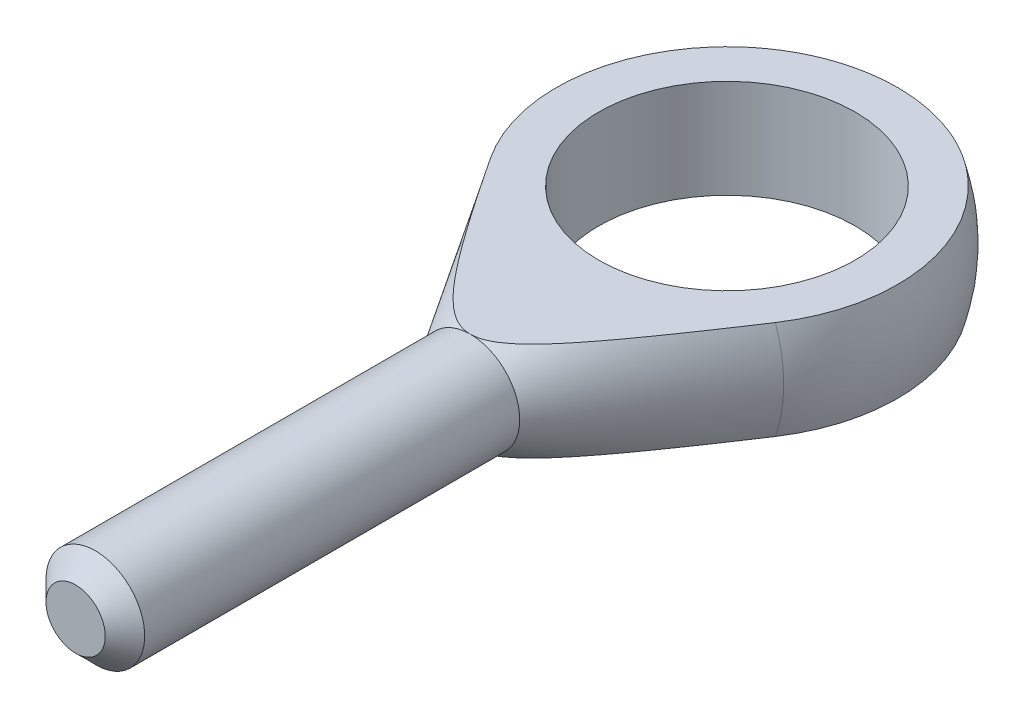
ISO-10303-21;
HEADER;
FILE_DESCRIPTION(('STEP AP214'),'2;1');
FILE_NAME('part.step','',(''),(''),'','','');
FILE_SCHEMA(('AUTOMOTIVE_DESIGN { 1 0 10303 214 1 1 1 1 }'));
ENDSEC;
DATA;
#1=APPLICATION_CONTEXT('core data for automotive mechanical design processes');
#2=APPLICATION_PROTOCOL_DEFINITION('international standard','automotive_design',2000,#1);
#3=PRODUCT_CONTEXT('',#1,'mechanical');
#4=PRODUCT('Part','Part','',(#3));
#5=PRODUCT_RELATED_PRODUCT_CATEGORY('part','',(#4));
#6=PRODUCT_DEFINITION_FORMATION('','',#4);
#7=PRODUCT_DEFINITION_CONTEXT('part definition',#1,'design');
#8=PRODUCT_DEFINITION('design','',#6,#7);
#9=PRODUCT_DEFINITION_SHAPE('','',#8);
#10=(LENGTH_UNIT() NAMED_UNIT(*) SI_UNIT(.MILLI.,.METRE.));
#11=(NAMED_UNIT(*) PLANE_ANGLE_UNIT() SI_UNIT($,.RADIAN.));
#12=(NAMED_UNIT(*) SI_UNIT($,.STERADIAN.) SOLID_ANGLE_UNIT());
#13=UNCERTAINTY_MEASURE_WITH_UNIT(LENGTH_MEASURE(1.E-05),#10,'distance_accuracy_value','');
#14=(GEOMETRIC_REPRESENTATION_CONTEXT(3) GLOBAL_UNCERTAINTY_ASSIGNED_CONTEXT((#13)) GLOBAL_UNIT_ASSIGNED_CONTEXT((#10,
#11,#12)) REPRESENTATION_CONTEXT('',''));
#15=CARTESIAN_POINT('',(0.,0.,0.));
#16=DIRECTION('',(0.,0.,1.));
#17=DIRECTION('',(1.,0.,0.));
#18=AXIS2_PLACEMENT_3D('',#15,#16,#17);
#19=CARTESIAN_POINT('',(0.,0.,13.));
#20=DIRECTION('',(0.,0.,-1.));
#21=DIRECTION('',(-1.,0.,0.));
#22=AXIS2_PLACEMENT_3D('',#19,#20,#21);
#23=CONICAL_SURFACE('',#22,2.5,0.557570628406619);
#24=CARTESIAN_POINT('',(0.,0.,4.7621370146182));
#25=DIRECTION('',(0.,0.,-1.));
#26=DIRECTION('',(-1.,0.,0.));
#27=AXIS2_PLACEMENT_3D('',#24,#25,#26);
#28=CIRCLE('',#27,7.63688752398537);
#29=CARTESIAN_POINT('',(-7.21609666329403,-2.5,4.7621370146182));
#30=VERTEX_POINT('',#29);
#31=CARTESIAN_POINT('',(-7.21609666329403,2.5,4.7621370146182));
#32=VERTEX_POINT('',#31);
#33=EDGE_CURVE('E97',#30,#32,#28,.T.);
#34=ORIENTED_EDGE('',*,*,#33,.F.);
#35=CARTESIAN_POINT('',(-18.2881757597772,-2.5,-12.5917539697787));
#36=CARTESIAN_POINT('',(-17.7682888026947,-2.5,-11.7657407888707));
#37=CARTESIAN_POINT('',(-17.248136660803,-2.5,-10.9398942340084));
#38=CARTESIAN_POINT('',(-16.207058131939,-2.5,-9.28867174331785));
#39=CARTESIAN_POINT('',(-15.686131733287,-2.5,-8.46329581485431));
#40=CARTESIAN_POINT('',(-14.6427591085271,-2.5,-6.81235822397228));
#41=CARTESIAN_POINT('',(-14.1203118871105,-2.5,-5.98679719031958));
#42=CARTESIAN_POINT('',(-13.0740307179517,-2.5,-4.33657004445696));
#43=CARTESIAN_POINT('',(-12.5501967893148,-2.5,-3.51190392013588));
#44=CARTESIAN_POINT('',(-11.4688660672409,-2.5,-1.81409004676087));
#45=CARTESIAN_POINT('',(-10.9112460131544,-2.5,-0.941020702201023));
#46=CARTESIAN_POINT('',(-10.0721913889547,-2.5,0.366927176896181));
#47=CARTESIAN_POINT('',(-9.79206288359678,-2.5,0.802643371143948));
#48=CARTESIAN_POINT('',(-9.23067810446317,-2.5,1.67334752542579));
#49=CARTESIAN_POINT('',(-8.94942183334861,-2.5,2.10833548717482));
#50=CARTESIAN_POINT('',(-8.3856511525547,-2.5,2.97702468216167));
#51=CARTESIAN_POINT('',(-8.1031378661137,-2.5,3.41072664376695));
#52=CARTESIAN_POINT('',(-7.53613047487403,-2.5,4.27683259865021));
#53=CARTESIAN_POINT('',(-7.2516363766262,-2.5,4.70923659621398));
#54=CARTESIAN_POINT('',(-6.67992160772568,-2.5,5.57219831538375));
#55=CARTESIAN_POINT('',(-6.3927011345619,-2.5,6.0027561674872));
#56=CARTESIAN_POINT('',(-5.95886243695519,-2.5,6.64656087812406));
#57=CARTESIAN_POINT('',(-5.8137495095323,-2.5,6.860821875155));
#58=CARTESIAN_POINT('',(-5.52227883374032,-2.5,7.28849502492086));
#59=CARTESIAN_POINT('',(-5.3759210911839,-2.5,7.50190718161262));
#60=CARTESIAN_POINT('',(-5.10207787126165,-2.5,7.89810293807199));
#61=CARTESIAN_POINT('',(-4.97479332060087,-2.5,8.08102531494501));
#62=CARTESIAN_POINT('',(-4.71879993180027,-2.5,8.44587885864129));
#63=CARTESIAN_POINT('',(-4.59009105767206,-2.5,8.62781000024486));
#64=CARTESIAN_POINT('',(-4.33074446945655,-2.5,8.99061800726985));
#65=CARTESIAN_POINT('',(-4.20010466388128,-2.5,9.17149338018632));
#66=CARTESIAN_POINT('',(-3.93656360351345,-2.5,9.53157546331069));
#67=CARTESIAN_POINT('',(-3.80366248795132,-2.5,9.71078227520941));
#68=CARTESIAN_POINT('',(-3.53623694800413,-2.5,10.0652044013027));
#69=CARTESIAN_POINT('',(-3.40174174798398,-2.5,10.2404416804207));
#70=CARTESIAN_POINT('',(-3.1288445434353,-2.5,10.5879300657296));
#71=CARTESIAN_POINT('',(-2.99044153180763,-2.5,10.7601803833312));
#72=CARTESIAN_POINT('',(-2.70855766832285,-2.5,11.100008435456));
#73=CARTESIAN_POINT('',(-2.56508637019778,-2.5,11.2675939972314));
#74=CARTESIAN_POINT('',(-2.34420443657334,-2.5,11.5138201849649));
#75=CARTESIAN_POINT('',(-2.26964874838444,-2.5,11.5950191558557));
#76=CARTESIAN_POINT('',(-2.11821185993539,-2.5,11.7552127642965));
#77=CARTESIAN_POINT('',(-2.0413309706652,-2.5,11.8342076939384));
#78=CARTESIAN_POINT('',(-1.90921725022562,-2.5,11.965047434545));
#79=CARTESIAN_POINT('',(-1.85473850281824,-2.5,12.0176528777633));
#80=CARTESIAN_POINT('',(-1.74420922953727,-2.5,12.1212037277911));
#81=CARTESIAN_POINT('',(-1.68815854232559,-2.5,12.1721489630342));
#82=CARTESIAN_POINT('',(-1.5740711440497,-2.5,12.2721260372992));
#83=CARTESIAN_POINT('',(-1.51602902352513,-2.5,12.3211517369287));
#84=CARTESIAN_POINT('',(-1.39783192904802,-2.5,12.4165928433272));
#85=CARTESIAN_POINT('',(-1.33767698892405,-2.5,12.4630082918582));
#86=CARTESIAN_POINT('',(-1.2140703737968,-2.5,12.5531367318292));
#87=CARTESIAN_POINT('',(-1.15058487685415,-2.5,12.5968041151025));
#88=CARTESIAN_POINT('',(-1.0208083247317,-2.5,12.6797139217727));
#89=CARTESIAN_POINT('',(-0.954516468686385,-2.5,12.7189550701637));
#90=CARTESIAN_POINT('',(-0.75146782596317,-2.5,12.8277611200423));
#91=CARTESIAN_POINT('',(-0.609770402141401,-2.5,12.8890055970211));
#92=CARTESIAN_POINT('',(-0.373520192393497,-2.5,12.9579292080534));
#93=CARTESIAN_POINT('',(-0.282397412226252,-2.5,12.9772064333061));
#94=CARTESIAN_POINT('',(-0.098198279336053,-2.5,12.9995975079074));
#95=CARTESIAN_POINT('',(-0.00512464905328752,-2.5,13.0027325487879));
#96=CARTESIAN_POINT('',(0.179996122096402,-2.5,12.9923649251489));
#97=CARTESIAN_POINT('',(0.27204372559783,-2.5,12.9788700928474));
#98=CARTESIAN_POINT('',(0.452809073253061,-2.5,12.9373094582093));
#99=CARTESIAN_POINT('',(0.541521468499796,-2.5,12.9092212380339));
#100=CARTESIAN_POINT('',(0.698697411022234,-2.5,12.847828221667));
#101=CARTESIAN_POINT('',(0.767917291021758,-2.5,12.8163909348296));
#102=CARTESIAN_POINT('',(0.903350894020853,-2.5,12.7475400960999));
#103=CARTESIAN_POINT('',(0.969562287205733,-2.5,12.7101220105843));
#104=CARTESIAN_POINT('',(1.09936359122282,-2.5,12.6305431750714));
#105=CARTESIAN_POINT('',(1.16294319091136,-2.5,12.5883658137448));
#106=CARTESIAN_POINT('',(1.28752364357328,-2.5,12.5004390874071));
#107=CARTESIAN_POINT('',(1.34852543712064,-2.5,12.4546910428974));
#108=CARTESIAN_POINT('',(1.51538398203663,-2.5,12.3233669992286));
#109=CARTESIAN_POINT('',(1.61882993285973,-2.5,12.2347366978852));
#110=CARTESIAN_POINT('',(1.82037566268882,-2.5,12.0515532168382));
#111=CARTESIAN_POINT('',(1.91847126723923,-2.5,11.9569955326721));
#112=CARTESIAN_POINT('',(2.11072271367264,-2.5,11.7635472703571));
#113=CARTESIAN_POINT('',(2.20486896739184,-2.5,11.6646472198529));
#114=CARTESIAN_POINT('',(2.38991415918624,-2.5,11.4638501163862));
#115=CARTESIAN_POINT('',(2.48081266587183,-2.5,11.3619526685408));
#116=CARTESIAN_POINT('',(2.66054095748691,-2.5,11.1553347812926));
#117=CARTESIAN_POINT('',(2.74935598928386,-2.5,11.0506015571392));
#118=CARTESIAN_POINT('',(2.92489565798002,-2.5,10.8393917254354));
#119=CARTESIAN_POINT('',(3.01162015897374,-2.5,10.7329150052919));
#120=CARTESIAN_POINT('',(3.18322336602367,-2.5,10.5187680656925));
#121=CARTESIAN_POINT('',(3.2681048129723,-2.5,10.4111000378492));
#122=CARTESIAN_POINT('',(3.43645627189603,-2.5,10.1946737963466));
#123=CARTESIAN_POINT('',(3.51992632865597,-2.5,10.085915617454));
#124=CARTESIAN_POINT('',(3.76606608608213,-2.5,9.76162856245453));
#125=CARTESIAN_POINT('',(3.92705372875055,-2.5,9.54482329717138));
#126=CARTESIAN_POINT('',(4.24576491214583,-2.5,9.10882276107777));
#127=CARTESIAN_POINT('',(4.40348829294268,-2.5,8.8896273739647));
#128=CARTESIAN_POINT('',(4.71650646632739,-2.5,8.44946171394241));
#129=CARTESIAN_POINT('',(4.87180088610348,-2.5,8.22849117629945));
#130=CARTESIAN_POINT('',(5.18050193501725,-2.5,7.78523412215401));
#131=CARTESIAN_POINT('',(5.33390854256231,-2.5,7.5629475906423));
#132=CARTESIAN_POINT('',(5.79223588980394,-2.5,6.89412941343366));
#133=CARTESIAN_POINT('',(6.09494921903567,-2.5,6.44608601289233));
#134=CARTESIAN_POINT('',(6.69654427945743,-2.5,5.54750251995014));
#135=CARTESIAN_POINT('',(6.99542635183088,-2.5,5.09696265505619));
#136=CARTESIAN_POINT('',(7.58894611070125,-2.5,4.1965843050114));
#137=CARTESIAN_POINT('',(7.88359800304257,-2.5,3.74675517655552));
#138=CARTESIAN_POINT('',(8.47103114885836,-2.5,2.84586412145668));
#139=CARTESIAN_POINT('',(8.76381235998802,-2.5,2.39480216723511));
#140=CARTESIAN_POINT('',(9.34784897059113,-2.5,1.49197191220457));
#141=CARTESIAN_POINT('',(9.63910498158493,-2.5,1.04020400677384));
#142=CARTESIAN_POINT('',(10.2205455996726,-2.5,0.135979050704919));
#143=CARTESIAN_POINT('',(10.5107302058402,-2.5,-0.316478000528654));
#144=CARTESIAN_POINT('',(11.4277010918932,-2.5,-1.7490966627965));
#145=CARTESIAN_POINT('',(12.0529656611428,-2.5,-2.73023206891367));
#146=CARTESIAN_POINT('',(13.3011892721116,-2.5,-4.6941709504664));
#147=CARTESIAN_POINT('',(13.924147957662,-2.5,-5.67697465197927));
#148=CARTESIAN_POINT('',(15.1713152421438,-2.5,-7.648108000279));
#149=CARTESIAN_POINT('',(15.7955164638271,-2.5,-8.63644231332962));
#150=CARTESIAN_POINT('',(17.0426559656668,-2.5,-10.613694502661));
#151=CARTESIAN_POINT('',(17.6655944257596,-2.5,-11.6026122654288));
#152=CARTESIAN_POINT('',(18.2881757597772,-2.5,-12.5917539697787));
#153=B_SPLINE_CURVE_WITH_KNOTS('',3,(#35,#36,#37,#38,#39,#40,#41,#42,#43,#44,#45,#46,#47,#48,
#49,#50,#51,#52,#53,#54,#55,#56,#57,#58,#59,#60,#61,#62,#63,#64,#65,#66,#67,#68,#69,#70,#71,#72,
#73,#74,#75,#76,#77,#78,#79,#80,#81,#82,#83,#84,#85,#86,#87,#88,#89,#90,#91,#92,#93,#94,#95,#96,
#97,#98,#99,#100,#101,#102,#103,#104,#105,#106,#107,#108,#109,#110,#111,#112,#113,#114,#115,
#116,#117,#118,#119,#120,#121,#122,#123,#124,#125,#126,#127,#128,#129,#130,#131,#132,#133,#134,
#135,#136,#137,#138,#139,#140,#141,#142,#143,#144,#145,#146,#147,#148,#149,#150,#151,#152),
.UNSPECIFIED.,.F.,.F.,(4,2,2,2,2,2,2,2,2,2,2,2,2,2,2,2,2,2,2,2,2,2,2,2,2,2,2,2,2,2,2,2,2,2,2,2,
2,2,2,2,2,2,2,2,2,2,2,2,2,2,2,2,2,2,2,2,2,2,4),(0.,2.92800678524869,5.85605819752975,
8.78701583191268,11.7179332930656,14.8257738356141,16.3797626504383,17.9337478005356,
19.4865476836905,21.0393424339418,22.5920255508061,23.368353309795,24.1446774457099,
24.8132210074027,25.4817814999356,26.1511287020946,26.8204348401508,27.4830947357422,
28.1459269957651,28.8075702957815,29.1382428246635,29.4688713207994,29.6960382991699,
29.9232286790683,30.1510945548394,30.378956783887,30.6099334291215,30.8409764396853,
31.3001689360316,31.5783794475503,31.8562246297722,32.1339390044647,32.4120812609321,
32.6398235463686,32.8677392931821,33.0964766920657,33.325129897031,33.7334154791419,
34.1420151867939,34.5515553980682,34.9611498067672,35.3730799754716,35.7850368519456,
36.1963320655631,36.6076142037868,37.4176845367706,38.2277944650192,39.0380275372785,
39.8482698683106,41.4703943636031,43.092373386648,44.7055912294916,46.3188454607327,
47.9313938705036,49.5439436742069,53.0342437887965,56.5250622263276,60.0318955460197,
63.5381880041753),.UNSPECIFIED.);
#154=CARTESIAN_POINT('',(0.,-2.5,13.));
#155=VERTEX_POINT('',#154);
#156=EDGE_CURVE('E93',#30,#155,#153,.T.);
#157=ORIENTED_EDGE('',*,*,#156,.T.);
#158=CARTESIAN_POINT('',(0.,0.,13.));
#159=DIRECTION('',(0.,0.,-1.));
#160=DIRECTION('',(-1.,0.,0.));
#161=AXIS2_PLACEMENT_3D('',#158,#159,#160);
#162=CIRCLE('',#161,2.5);
#163=CARTESIAN_POINT('',(0.,2.5,13.));
#164=VERTEX_POINT('',#163);
#165=EDGE_CURVE('E92',#155,#164,#162,.T.);
#166=ORIENTED_EDGE('',*,*,#165,.T.);
#167=CARTESIAN_POINT('',(18.2881757597772,2.5,-12.5917539697787));
#168=CARTESIAN_POINT('',(17.7682888026947,2.5,-11.7657407888707));
#169=CARTESIAN_POINT('',(17.248136660803,2.5,-10.9398942340084));
#170=CARTESIAN_POINT('',(16.207058131939,2.5,-9.28867174331785));
#171=CARTESIAN_POINT('',(15.686131733287,2.5,-8.46329581485431));
#172=CARTESIAN_POINT('',(14.6427591085271,2.5,-6.81235822397228));
#173=CARTESIAN_POINT('',(14.1203118871105,2.5,-5.98679719031958));
#174=CARTESIAN_POINT('',(13.0740307179517,2.5,-4.33657004445696));
#175=CARTESIAN_POINT('',(12.5501967893148,2.5,-3.51190392013588));
#176=CARTESIAN_POINT('',(11.4688660672409,2.5,-1.81409004676087));
#177=CARTESIAN_POINT('',(10.9112460131544,2.5,-0.941020702201023));
#178=CARTESIAN_POINT('',(10.0721913889547,2.5,0.366927176896181));
#179=CARTESIAN_POINT('',(9.79206288359678,2.5,0.802643371143948));
#180=CARTESIAN_POINT('',(9.23067810446317,2.5,1.67334752542579));
#181=CARTESIAN_POINT('',(8.94942183334861,2.5,2.10833548717482));
#182=CARTESIAN_POINT('',(8.3856511525547,2.5,2.97702468216167));
#183=CARTESIAN_POINT('',(8.1031378661137,2.5,3.41072664376695));
#184=CARTESIAN_POINT('',(7.53613047487403,2.5,4.27683259865021));
#185=CARTESIAN_POINT('',(7.2516363766262,2.5,4.70923659621398));
#186=CARTESIAN_POINT('',(6.67992160772568,2.5,5.57219831538375));
#187=CARTESIAN_POINT('',(6.3927011345619,2.5,6.0027561674872));
#188=CARTESIAN_POINT('',(5.95886243695519,2.5,6.64656087812406));
#189=CARTESIAN_POINT('',(5.8137495095323,2.5,6.860821875155));
#190=CARTESIAN_POINT('',(5.52227883374032,2.5,7.28849502492086));
#191=CARTESIAN_POINT('',(5.3759210911839,2.5,7.50190718161262));
#192=CARTESIAN_POINT('',(5.10207787126165,2.5,7.89810293807199));
#193=CARTESIAN_POINT('',(4.97479332060087,2.5,8.08102531494501));
#194=CARTESIAN_POINT('',(4.71879993180027,2.5,8.44587885864129));
#195=CARTESIAN_POINT('',(4.59009105767206,2.5,8.62781000024486));
#196=CARTESIAN_POINT('',(4.33074446945655,2.5,8.99061800726985));
#197=CARTESIAN_POINT('',(4.20010466388128,2.5,9.17149338018632));
#198=CARTESIAN_POINT('',(3.93656360351345,2.5,9.53157546331069));
#199=CARTESIAN_POINT('',(3.80366248795132,2.5,9.71078227520941));
#200=CARTESIAN_POINT('',(3.53623694800413,2.5,10.0652044013027));
#201=CARTESIAN_POINT('',(3.40174174798398,2.5,10.2404416804207));
#202=CARTESIAN_POINT('',(3.1288445434353,2.5,10.5879300657296));
#203=CARTESIAN_POINT('',(2.99044153180763,2.5,10.7601803833312));
#204=CARTESIAN_POINT('',(2.70855766832285,2.5,11.100008435456));
#205=CARTESIAN_POINT('',(2.56508637019778,2.5,11.2675939972314));
#206=CARTESIAN_POINT('',(2.34420443657334,2.5,11.5138201849649));
#207=CARTESIAN_POINT('',(2.26964874838444,2.5,11.5950191558557));
#208=CARTESIAN_POINT('',(2.11821185993539,2.5,11.7552127642965));
#209=CARTESIAN_POINT('',(2.0413309706652,2.5,11.8342076939384));
#210=CARTESIAN_POINT('',(1.90921725022562,2.5,11.965047434545));
#211=CARTESIAN_POINT('',(1.85473850281824,2.5,12.0176528777633));
#212=CARTESIAN_POINT('',(1.74420922953727,2.5,12.1212037277911));
#213=CARTESIAN_POINT('',(1.68815854232559,2.5,12.1721489630342));
#214=CARTESIAN_POINT('',(1.5740711440497,2.5,12.2721260372992));
#215=CARTESIAN_POINT('',(1.51602902352513,2.5,12.3211517369287));
#216=CARTESIAN_POINT('',(1.39783192904802,2.5,12.4165928433272));
#217=CARTESIAN_POINT('',(1.33767698892405,2.5,12.4630082918582));
#218=CARTESIAN_POINT('',(1.2140703737968,2.5,12.5531367318292));
#219=CARTESIAN_POINT('',(1.15058487685415,2.5,12.5968041151025));
#220=CARTESIAN_POINT('',(1.0208083247317,2.5,12.6797139217727));
#221=CARTESIAN_POINT('',(0.954516468686385,2.5,12.7189550701637));
#222=CARTESIAN_POINT('',(0.75146782596317,2.5,12.8277611200423));
#223=CARTESIAN_POINT('',(0.609770402141401,2.5,12.8890055970211));
#224=CARTESIAN_POINT('',(0.373520192393497,2.5,12.9579292080534));
#225=CARTESIAN_POINT('',(0.282397412226252,2.5,12.9772064333061));
#226=CARTESIAN_POINT('',(0.098198279336053,2.5,12.9995975079074));
#227=CARTESIAN_POINT('',(0.00512464905328752,2.5,13.0027325487879));
#228=CARTESIAN_POINT('',(-0.179996122096402,2.5,12.9923649251489));
#229=CARTESIAN_POINT('',(-0.27204372559783,2.5,12.9788700928474));
#230=CARTESIAN_POINT('',(-0.452809073253061,2.5,12.9373094582093));
#231=CARTESIAN_POINT('',(-0.541521468499796,2.5,12.9092212380339));
#232=CARTESIAN_POINT('',(-0.698697411022234,2.5,12.847828221667));
#233=CARTESIAN_POINT('',(-0.767917291021758,2.5,12.8163909348296));
#234=CARTESIAN_POINT('',(-0.903350894020853,2.5,12.7475400960999));
#235=CARTESIAN_POINT('',(-0.969562287205733,2.5,12.7101220105843));
#236=CARTESIAN_POINT('',(-1.09936359122282,2.5,12.6305431750714));
#237=CARTESIAN_POINT('',(-1.16294319091136,2.5,12.5883658137448));
#238=CARTESIAN_POINT('',(-1.28752364357328,2.5,12.5004390874071));
#239=CARTESIAN_POINT('',(-1.34852543712064,2.5,12.4546910428974));
#240=CARTESIAN_POINT('',(-1.51538398203663,2.5,12.3233669992286));
#241=CARTESIAN_POINT('',(-1.61882993285973,2.5,12.2347366978852));
#242=CARTESIAN_POINT('',(-1.82037566268882,2.5,12.0515532168382));
#243=CARTESIAN_POINT('',(-1.91847126723923,2.5,11.9569955326721));
#244=CARTESIAN_POINT('',(-2.11072271367264,2.5,11.7635472703571));
#245=CARTESIAN_POINT('',(-2.20486896739184,2.5,11.6646472198529));
#246=CARTESIAN_POINT('',(-2.38991415918624,2.5,11.4638501163862));
#247=CARTESIAN_POINT('',(-2.48081266587183,2.5,11.3619526685408));
#248=CARTESIAN_POINT('',(-2.66054095748691,2.5,11.1553347812926));
#249=CARTESIAN_POINT('',(-2.74935598928386,2.5,11.0506015571392));
#250=CARTESIAN_POINT('',(-2.92489565798002,2.5,10.8393917254354));
#251=CARTESIAN_POINT('',(-3.01162015897374,2.5,10.7329150052919));
#252=CARTESIAN_POINT('',(-3.18322336602367,2.5,10.5187680656925));
#253=CARTESIAN_POINT('',(-3.2681048129723,2.5,10.4111000378492));
#254=CARTESIAN_POINT('',(-3.43645627189603,2.5,10.1946737963466));
#255=CARTESIAN_POINT('',(-3.51992632865597,2.5,10.085915617454));
#256=CARTESIAN_POINT('',(-3.76606608608213,2.5,9.76162856245453));
#257=CARTESIAN_POINT('',(-3.92705372875055,2.5,9.54482329717138));
#258=CARTESIAN_POINT('',(-4.24576491214583,2.5,9.10882276107777));
#259=CARTESIAN_POINT('',(-4.40348829294268,2.5,8.8896273739647));
#260=CARTESIAN_POINT('',(-4.71650646632739,2.5,8.44946171394241));
#261=CARTESIAN_POINT('',(-4.87180088610348,2.5,8.22849117629945));
#262=CARTESIAN_POINT('',(-5.18050193501725,2.5,7.78523412215401));
#263=CARTESIAN_POINT('',(-5.33390854256231,2.5,7.5629475906423));
#264=CARTESIAN_POINT('',(-5.79223588980394,2.5,6.89412941343366));
#265=CARTESIAN_POINT('',(-6.09494921903567,2.5,6.44608601289233));
#266=CARTESIAN_POINT('',(-6.69654427945743,2.5,5.54750251995014));
#267=CARTESIAN_POINT('',(-6.99542635183088,2.5,5.09696265505619));
#268=CARTESIAN_POINT('',(-7.58894611070125,2.5,4.1965843050114));
#269=CARTESIAN_POINT('',(-7.88359800304257,2.5,3.74675517655552));
#270=CARTESIAN_POINT('',(-8.47103114885836,2.5,2.84586412145668));
#271=CARTESIAN_POINT('',(-8.76381235998802,2.5,2.39480216723511));
#272=CARTESIAN_POINT('',(-9.34784897059113,2.5,1.49197191220457));
#273=CARTESIAN_POINT('',(-9.63910498158493,2.5,1.04020400677384));
#274=CARTESIAN_POINT('',(-10.2205455996726,2.5,0.135979050704919));
#275=CARTESIAN_POINT('',(-10.5107302058402,2.5,-0.316478000528654));
#276=CARTESIAN_POINT('',(-11.4277010918932,2.5,-1.7490966627965));
#277=CARTESIAN_POINT('',(-12.0529656611428,2.5,-2.73023206891367));
#278=CARTESIAN_POINT('',(-13.3011892721116,2.5,-4.6941709504664));
#279=CARTESIAN_POINT('',(-13.924147957662,2.5,-5.67697465197927));
#280=CARTESIAN_POINT('',(-15.1713152421438,2.5,-7.648108000279));
#281=CARTESIAN_POINT('',(-15.7955164638271,2.5,-8.63644231332962));
#282=CARTESIAN_POINT('',(-17.0426559656668,2.5,-10.613694502661));
#283=CARTESIAN_POINT('',(-17.6655944257596,2.5,-11.6026122654288));
#284=CARTESIAN_POINT('',(-18.2881757597772,2.5,-12.5917539697787));
#285=B_SPLINE_CURVE_WITH_KNOTS('',3,(#167,#168,#169,#170,#171,#172,#173,#174,#175,#176,#177,
#178,#179,#180,#181,#182,#183,#184,#185,#186,#187,#188,#189,#190,#191,#192,#193,#194,#195,#196,
#197,#198,#199,#200,#201,#202,#203,#204,#205,#206,#207,#208,#209,#210,#211,#212,#213,#214,#215,
#216,#217,#218,#219,#220,#221,#222,#223,#224,#225,#226,#227,#228,#229,#230,#231,#232,#233,#234,
#235,#236,#237,#238,#239,#240,#241,#242,#243,#244,#245,#246,#247,#248,#249,#250,#251,#252,#253,
#254,#255,#256,#257,#258,#259,#260,#261,#262,#263,#264,#265,#266,#267,#268,#269,#270,#271,#272,
#273,#274,#275,#276,#277,#278,#279,#280,#281,#282,#283,#284),.UNSPECIFIED.,.F.,.F.,(4,2,2,2,2,2,
2,2,2,2,2,2,2,2,2,2,2,2,2,2,2,2,2,2,2,2,2,2,2,2,2,2,2,2,2,2,2,2,2,2,2,2,2,2,2,2,2,2,2,2,2,2,2,2,
2,2,2,2,4),(0.,2.92800678524869,5.85605819752975,8.78701583191268,11.7179332930656,
14.8257738356141,16.3797626504383,17.9337478005356,19.4865476836905,21.0393424339418,
22.5920255508061,23.368353309795,24.1446774457099,24.8132210074027,25.4817814999356,
26.1511287020946,26.8204348401508,27.4830947357422,28.1459269957651,28.8075702957815,
29.1382428246635,29.4688713207994,29.6960382991699,29.9232286790683,30.1510945548394,
30.378956783887,30.6099334291215,30.8409764396853,31.3001689360316,31.5783794475503,
31.8562246297722,32.1339390044647,32.4120812609321,32.6398235463686,32.8677392931821,
33.0964766920657,33.325129897031,33.7334154791419,34.1420151867939,34.5515553980682,
34.9611498067672,35.3730799754716,35.7850368519456,36.1963320655631,36.6076142037868,
37.4176845367706,38.2277944650192,39.0380275372785,39.8482698683106,41.4703943636031,
43.092373386648,44.7055912294916,46.3188454607327,47.9313938705036,49.5439436742069,
53.0342437887965,56.5250622263276,60.0318955460197,63.5381880041753),.UNSPECIFIED.);
#286=EDGE_CURVE('E72',#164,#32,#285,.T.);
#287=ORIENTED_EDGE('',*,*,#286,.T.);
#288=EDGE_LOOP('',(#34,#157,#166,#287));
#289=FACE_BOUND('',#288,.T.);
#290=ADVANCED_FACE('F37',(#289),#23,.T.);
#291=EDGE_CURVE('E87',#164,#155,#162,.T.);
#292=ORIENTED_EDGE('',*,*,#291,.T.);
#293=CARTESIAN_POINT('',(7.21609666329403,-2.5,4.7621370146182));
#294=VERTEX_POINT('',#293);
#295=EDGE_CURVE('E89',#155,#294,#153,.T.);
#296=ORIENTED_EDGE('',*,*,#295,.T.);
#297=CARTESIAN_POINT('',(7.21609666329403,2.5,4.7621370146182));
#298=VERTEX_POINT('',#297);
#299=EDGE_CURVE('E88',#298,#294,#28,.T.);
#300=ORIENTED_EDGE('',*,*,#299,.F.);
#301=EDGE_CURVE('E75',#298,#164,#285,.T.);
#302=ORIENTED_EDGE('',*,*,#301,.T.);
#303=EDGE_LOOP('',(#292,#296,#300,#302));
#304=FACE_BOUND('',#303,.T.);
#305=ADVANCED_FACE('F85',(#304),#23,.T.);
#306=CARTESIAN_POINT('',(0.,0.,0.));
#307=DIRECTION('',(0.,0.,-1.));
#308=DIRECTION('',(1.,0.,0.));
#309=AXIS2_PLACEMENT_3D('',#306,#307,#308);
#310=SPHERICAL_SURFACE('',#309,9.);
#311=CARTESIAN_POINT('',(0.,-2.5,0.));
#312=DIRECTION('',(0.,1.,0.));
#313=DIRECTION('',(0.,0.,1.));
#314=AXIS2_PLACEMENT_3D('',#311,#312,#313);
#315=CIRCLE('',#314,8.64580823289529);
#316=EDGE_CURVE('E53',#294,#30,#315,.T.);
#317=ORIENTED_EDGE('',*,*,#316,.T.);
#318=ORIENTED_EDGE('',*,*,#33,.T.);
#319=CARTESIAN_POINT('',(0.,2.5,0.));
#320=DIRECTION('',(0.,-1.,0.));
#321=DIRECTION('',(0.,0.,-1.));
#322=AXIS2_PLACEMENT_3D('',#319,#320,#321);
#323=CIRCLE('',#322,8.64580823289529);
#324=EDGE_CURVE('E77',#32,#298,#323,.T.);
#325=ORIENTED_EDGE('',*,*,#324,.T.);
#326=ORIENTED_EDGE('',*,*,#299,.T.);
#327=EDGE_LOOP('',(#317,#318,#325,#326));
#328=FACE_BOUND('',#327,.T.);
#329=ADVANCED_FACE('F125',(#328),#310,.T.);
#330=CARTESIAN_POINT('',(0.,0.,33.));
#331=DIRECTION('',(0.,0.,-1.));
#332=DIRECTION('',(-1.,0.,0.));
#333=AXIS2_PLACEMENT_3D('',#330,#331,#332);
#334=PLANE('',#333);
#335=CARTESIAN_POINT('',(0.,0.,33.));
#336=DIRECTION('',(0.,0.,-1.));
#337=DIRECTION('',(-1.,0.,0.));
#338=AXIS2_PLACEMENT_3D('',#335,#336,#337);
#339=CIRCLE('',#338,1.5);
#340=CARTESIAN_POINT('',(-1.5,0.,33.));
#341=VERTEX_POINT('',#340);
#342=EDGE_CURVE('E11',#341,#341,#339,.F.);
#343=ORIENTED_EDGE('',*,*,#342,.T.);
#344=EDGE_LOOP('',(#343));
#345=FACE_BOUND('',#344,.T.);
#346=ADVANCED_FACE('F143',(#345),#334,.F.);
#347=CARTESIAN_POINT('',(0.,0.,-26.0435164980697));
#348=DIRECTION('',(0.,0.,-1.));
#349=DIRECTION('',(-1.,0.,0.));
#350=AXIS2_PLACEMENT_3D('',#347,#348,#349);
#351=CYLINDRICAL_SURFACE('',#350,2.5);
#352=CARTESIAN_POINT('',(0.,0.,32.));
#353=DIRECTION('',(0.,0.,-1.));
#354=DIRECTION('',(-1.,0.,0.));
#355=AXIS2_PLACEMENT_3D('',#352,#353,#354);
#356=CIRCLE('',#355,2.5);
#357=CARTESIAN_POINT('',(-2.5,0.,32.));
#358=VERTEX_POINT('',#357);
#359=EDGE_CURVE('E46',#358,#358,#356,.T.);
#360=ORIENTED_EDGE('',*,*,#359,.T.);
#361=EDGE_LOOP('',(#360));
#362=FACE_BOUND('',#361,.T.);
#363=ORIENTED_EDGE('',*,*,#291,.F.);
#364=ORIENTED_EDGE('',*,*,#165,.F.);
#365=EDGE_LOOP('',(#363,#364));
#366=FACE_BOUND('',#365,.T.);
#367=ADVANCED_FACE('F96',(#362,#366),#351,.T.);
#368=CARTESIAN_POINT('',(-9.,2.5,13.));
#369=DIRECTION('',(0.,-1.,0.));
#370=DIRECTION('',(0.,0.,-1.));
#371=AXIS2_PLACEMENT_3D('',#368,#369,#370);
#372=PLANE('',#371);
#373=CARTESIAN_POINT('',(0.,2.50000000000001,0.));
#374=DIRECTION('',(0.,1.,0.));
#375=DIRECTION('',(0.,0.,1.));
#376=AXIS2_PLACEMENT_3D('',#373,#374,#375);
#377=CIRCLE('',#376,6.5);
#378=CARTESIAN_POINT('',(0.,2.50000000000001,6.5));
#379=VERTEX_POINT('',#378);
#380=EDGE_CURVE('E201',#379,#379,#377,.T.);
#381=ORIENTED_EDGE('',*,*,#380,.F.);
#382=EDGE_LOOP('',(#381));
#383=FACE_BOUND('',#382,.T.);
#384=ORIENTED_EDGE('',*,*,#301,.F.);
#385=ORIENTED_EDGE('',*,*,#324,.F.);
#386=ORIENTED_EDGE('',*,*,#286,.F.);
#387=EDGE_LOOP('',(#384,#385,#386));
#388=FACE_BOUND('',#387,.T.);
#389=ADVANCED_FACE('F74',(#383,#388),#372,.F.);
#390=CARTESIAN_POINT('',(-9.,-2.5,13.));
#391=DIRECTION('',(0.,1.,0.));
#392=DIRECTION('',(0.,0.,1.));
#393=AXIS2_PLACEMENT_3D('',#390,#391,#392);
#394=PLANE('',#393);
#395=CARTESIAN_POINT('',(0.,-2.50000000000001,0.));
#396=DIRECTION('',(0.,1.,0.));
#397=DIRECTION('',(0.,0.,1.));
#398=AXIS2_PLACEMENT_3D('',#395,#396,#397);
#399=CIRCLE('',#398,6.5);
#400=CARTESIAN_POINT('',(0.,-2.50000000000001,6.5));
#401=VERTEX_POINT('',#400);
#402=EDGE_CURVE('E81',#401,#401,#399,.T.);
#403=ORIENTED_EDGE('',*,*,#402,.T.);
#404=EDGE_LOOP('',(#403));
#405=FACE_BOUND('',#404,.T.);
#406=ORIENTED_EDGE('',*,*,#156,.F.);
#407=ORIENTED_EDGE('',*,*,#316,.F.);
#408=ORIENTED_EDGE('',*,*,#295,.F.);
#409=EDGE_LOOP('',(#406,#407,#408));
#410=FACE_BOUND('',#409,.T.);
#411=ADVANCED_FACE('F117',(#405,#410),#394,.F.);
#412=CARTESIAN_POINT('',(0.,-2.50000000000001,0.));
#413=DIRECTION('',(0.,1.,0.));
#414=DIRECTION('',(0.,0.,1.));
#415=AXIS2_PLACEMENT_3D('',#412,#413,#414);
#416=CYLINDRICAL_SURFACE('',#415,6.5);
#417=ORIENTED_EDGE('',*,*,#402,.F.);
#418=EDGE_LOOP('',(#417));
#419=FACE_BOUND('',#418,.T.);
#420=ORIENTED_EDGE('',*,*,#380,.T.);
#421=EDGE_LOOP('',(#420));
#422=FACE_BOUND('',#421,.T.);
#423=ADVANCED_FACE('F112',(#419,#422),#416,.F.);
#424=CARTESIAN_POINT('',(0.,0.,32.));
#425=DIRECTION('',(0.,0.,-1.));
#426=DIRECTION('',(-1.,0.,0.));
#427=AXIS2_PLACEMENT_3D('',#424,#425,#426);
#428=CONICAL_SURFACE('',#427,2.5,0.785398163397454);
#429=ORIENTED_EDGE('',*,*,#342,.F.);
#430=EDGE_LOOP('',(#429));
#431=FACE_BOUND('',#430,.T.);
#432=ORIENTED_EDGE('',*,*,#359,.F.);
#433=EDGE_LOOP('',(#432));
#434=FACE_BOUND('',#433,.T.);
#435=ADVANCED_FACE('F40',(#431,#434),#428,.T.);
#436=CLOSED_SHELL('',(#290,#305,#329,#346,#367,#389,#411,#423,#435));
#437=MANIFOLD_SOLID_BREP('B2',#436);
#438=ADVANCED_BREP_SHAPE_REPRESENTATION('',(#18,#437),#14);
#439=SHAPE_DEFINITION_REPRESENTATION(#9,#438);
ENDSEC;
END-ISO-10303-21;
